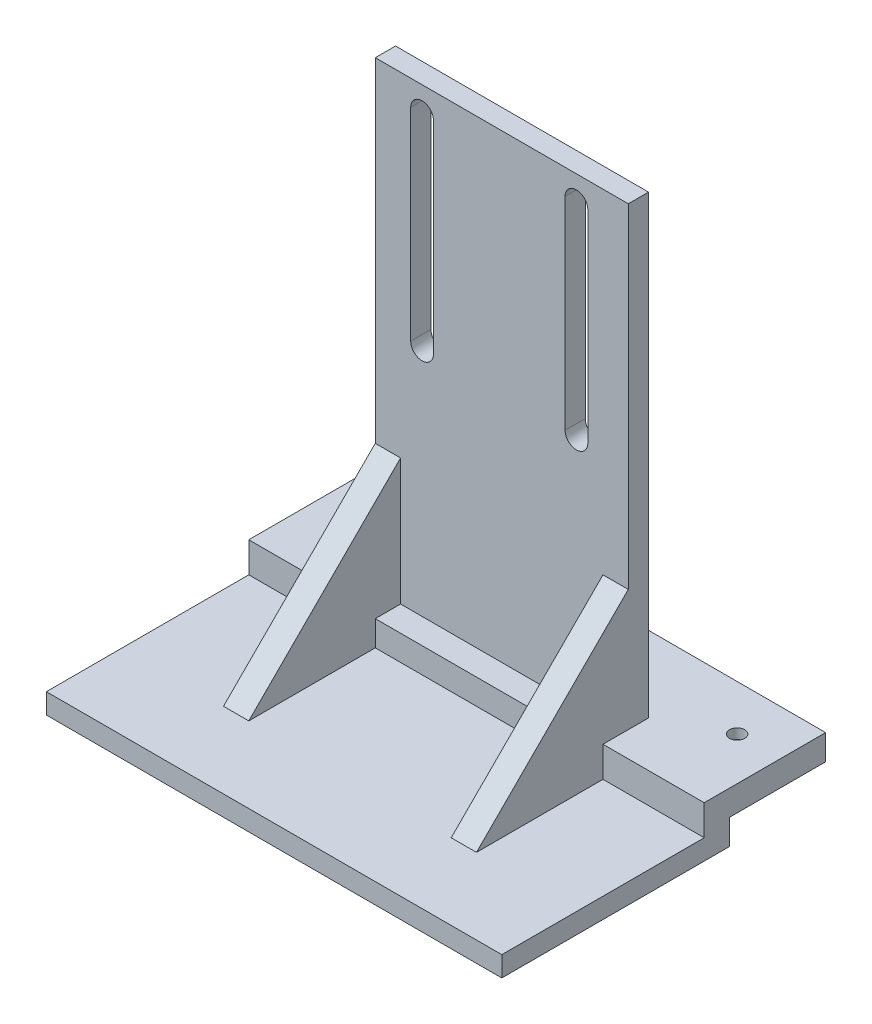
ISO-10303-21;
HEADER;
FILE_DESCRIPTION(('STEP AP214'),'2;1');
FILE_NAME('part.step','',(''),(''),'','','');
FILE_SCHEMA(('AUTOMOTIVE_DESIGN { 1 0 10303 214 1 1 1 1 }'));
ENDSEC;
DATA;
#1=APPLICATION_CONTEXT('core data for automotive mechanical design processes');
#2=APPLICATION_PROTOCOL_DEFINITION('international standard','automotive_design',2000,#1);
#3=PRODUCT_CONTEXT('',#1,'mechanical');
#4=PRODUCT('Part','Part','',(#3));
#5=PRODUCT_RELATED_PRODUCT_CATEGORY('part','',(#4));
#6=PRODUCT_DEFINITION_FORMATION('','',#4);
#7=PRODUCT_DEFINITION_CONTEXT('part definition',#1,'design');
#8=PRODUCT_DEFINITION('design','',#6,#7);
#9=PRODUCT_DEFINITION_SHAPE('','',#8);
#10=(LENGTH_UNIT() NAMED_UNIT(*) SI_UNIT(.MILLI.,.METRE.));
#11=(NAMED_UNIT(*) PLANE_ANGLE_UNIT() SI_UNIT($,.RADIAN.));
#12=(NAMED_UNIT(*) SI_UNIT($,.STERADIAN.) SOLID_ANGLE_UNIT());
#13=UNCERTAINTY_MEASURE_WITH_UNIT(LENGTH_MEASURE(1.E-05),#10,'distance_accuracy_value','');
#14=(GEOMETRIC_REPRESENTATION_CONTEXT(3) GLOBAL_UNCERTAINTY_ASSIGNED_CONTEXT((#13)) GLOBAL_UNIT_ASSIGNED_CONTEXT((#10,
#11,#12)) REPRESENTATION_CONTEXT('',''));
#15=CARTESIAN_POINT('',(0.,0.,0.));
#16=DIRECTION('',(0.,0.,1.));
#17=DIRECTION('',(1.,0.,0.));
#18=AXIS2_PLACEMENT_3D('',#15,#16,#17);
#19=CARTESIAN_POINT('',(-40.8939600904813,-66.0737955049441,-6.));
#20=DIRECTION('',(0.,1.,0.));
#21=DIRECTION('',(-1.,0.,0.));
#22=AXIS2_PLACEMENT_3D('',#19,#20,#21);
#23=CYLINDRICAL_SURFACE('',#22,1.5);
#24=CARTESIAN_POINT('',(-40.8939600904813,-56.0727955049441,-6.));
#25=DIRECTION('',(0.,1.,0.));
#26=DIRECTION('',(-1.,0.,0.));
#27=AXIS2_PLACEMENT_3D('',#24,#25,#26);
#28=CIRCLE('',#27,1.5);
#29=CARTESIAN_POINT('',(-42.3939600904813,-56.0727955049441,-6.));
#30=VERTEX_POINT('',#29);
#31=EDGE_CURVE('E264',#30,#30,#28,.T.);
#32=ORIENTED_EDGE('',*,*,#31,.T.);
#33=EDGE_LOOP('',(#32));
#34=FACE_BOUND('',#33,.T.);
#35=CARTESIAN_POINT('',(-40.8939600904813,-58.0727955049441,-6.));
#36=DIRECTION('',(0.,-1.,0.));
#37=DIRECTION('',(0.,0.,-1.));
#38=AXIS2_PLACEMENT_3D('',#35,#36,#37);
#39=CIRCLE('',#38,1.5);
#40=CARTESIAN_POINT('',(-40.8939600904813,-58.0727955049441,-7.5));
#41=VERTEX_POINT('',#40);
#42=EDGE_CURVE('E43',#41,#41,#39,.F.);
#43=ORIENTED_EDGE('',*,*,#42,.F.);
#44=EDGE_LOOP('',(#43));
#45=FACE_BOUND('',#44,.T.);
#46=ADVANCED_FACE('F39',(#34,#45),#23,.F.);
#47=CARTESIAN_POINT('',(32.1060399095187,-66.0737955049441,-6.));
#48=DIRECTION('',(0.,1.,0.));
#49=DIRECTION('',(-1.,0.,0.));
#50=AXIS2_PLACEMENT_3D('',#47,#48,#49);
#51=CYLINDRICAL_SURFACE('',#50,1.5);
#52=CARTESIAN_POINT('',(32.1060399095187,-56.0727955049441,-6.));
#53=DIRECTION('',(0.,1.,0.));
#54=DIRECTION('',(-1.,0.,0.));
#55=AXIS2_PLACEMENT_3D('',#52,#53,#54);
#56=CIRCLE('',#55,1.5);
#57=CARTESIAN_POINT('',(30.6060399095187,-56.0727955049441,-6.));
#58=VERTEX_POINT('',#57);
#59=EDGE_CURVE('E288',#58,#58,#56,.T.);
#60=ORIENTED_EDGE('',*,*,#59,.T.);
#61=EDGE_LOOP('',(#60));
#62=FACE_BOUND('',#61,.T.);
#63=CARTESIAN_POINT('',(32.1060399095187,-58.0727955049441,-6.));
#64=DIRECTION('',(0.,-1.,0.));
#65=DIRECTION('',(0.,0.,-1.));
#66=AXIS2_PLACEMENT_3D('',#63,#64,#65);
#67=CIRCLE('',#66,1.5);
#68=CARTESIAN_POINT('',(32.1060399095187,-58.0727955049441,-7.5));
#69=VERTEX_POINT('',#68);
#70=EDGE_CURVE('E532',#69,#69,#67,.F.);
#71=ORIENTED_EDGE('',*,*,#70,.F.);
#72=EDGE_LOOP('',(#71));
#73=FACE_BOUND('',#72,.T.);
#74=ADVANCED_FACE('F621',(#62,#73),#51,.F.);
#75=CARTESIAN_POINT('',(-29.3939600904813,33.9272044950559,4.));
#76=DIRECTION('',(1.,0.,0.));
#77=DIRECTION('',(0.,1.,0.));
#78=AXIS2_PLACEMENT_3D('',#75,#76,#77);
#79=PLANE('',#78);
#80=DIRECTION('',(0.,0.,-1.));
#81=VECTOR('',#80,1.);
#82=CARTESIAN_POINT('',(-29.3939600904812,-56.0727955049441,-15.));
#83=LINE('',#82,#81);
#84=CARTESIAN_POINT('',(-29.3939600904812,-56.0727955049441,9.));
#85=VERTEX_POINT('',#84);
#86=CARTESIAN_POINT('',(-29.3939600904812,-56.0727955049441,0.));
#87=VERTEX_POINT('',#86);
#88=EDGE_CURVE('E57',#85,#87,#83,.T.);
#89=ORIENTED_EDGE('',*,*,#88,.F.);
#90=DIRECTION('',(0.,1.,0.));
#91=VECTOR('',#90,1.);
#92=CARTESIAN_POINT('',(-29.3939600904812,-56.0727955049441,9.));
#93=LINE('',#92,#91);
#94=CARTESIAN_POINT('',(-29.3939600904812,-62.0727955049441,9.));
#95=VERTEX_POINT('',#94);
#96=EDGE_CURVE('E261',#95,#85,#93,.T.);
#97=ORIENTED_EDGE('',*,*,#96,.F.);
#98=DIRECTION('',(0.,0.,-1.));
#99=VECTOR('',#98,1.);
#100=CARTESIAN_POINT('',(-29.3939600904812,-62.0727955049441,9.));
#101=LINE('',#100,#99);
#102=CARTESIAN_POINT('',(-29.3939600904812,-62.0727955049441,34.));
#103=VERTEX_POINT('',#102);
#104=EDGE_CURVE('E11',#103,#95,#101,.T.);
#105=ORIENTED_EDGE('',*,*,#104,.F.);
#106=DIRECTION('',(0.,0.707106781186548,-0.707106781186547));
#107=VECTOR('',#106,1.);
#108=CARTESIAN_POINT('',(-29.3939600904812,-32.0727955049441,4.));
#109=LINE('',#108,#107);
#110=CARTESIAN_POINT('',(-29.3939600904812,-32.0727955049441,4.));
#111=VERTEX_POINT('',#110);
#112=EDGE_CURVE('E364',#103,#111,#109,.T.);
#113=ORIENTED_EDGE('',*,*,#112,.T.);
#114=DIRECTION('',(0.,-1.,0.));
#115=VECTOR('',#114,1.);
#116=CARTESIAN_POINT('',(-29.3939600904813,33.9272044950559,4.));
#117=LINE('',#116,#115);
#118=CARTESIAN_POINT('',(-29.3939600904813,33.9272044950559,4.));
#119=VERTEX_POINT('',#118);
#120=EDGE_CURVE('E504',#119,#111,#117,.T.);
#121=ORIENTED_EDGE('',*,*,#120,.F.);
#122=DIRECTION('',(0.,0.,-1.));
#123=VECTOR('',#122,1.);
#124=CARTESIAN_POINT('',(-29.3939600904813,33.9272044950559,4.));
#125=LINE('',#124,#123);
#126=CARTESIAN_POINT('',(-29.3939600904813,33.9272044950559,0.));
#127=VERTEX_POINT('',#126);
#128=EDGE_CURVE('E515',#119,#127,#125,.T.);
#129=ORIENTED_EDGE('',*,*,#128,.T.);
#130=DIRECTION('',(0.,-1.,0.));
#131=VECTOR('',#130,1.);
#132=CARTESIAN_POINT('',(-29.3939600904813,33.9272044950559,0.));
#133=LINE('',#132,#131);
#134=EDGE_CURVE('E501',#127,#87,#133,.T.);
#135=ORIENTED_EDGE('',*,*,#134,.T.);
#136=EDGE_LOOP('',(#89,#97,#105,#113,#121,#129,#135));
#137=FACE_BOUND('',#136,.T.);
#138=ADVANCED_FACE('F41',(#137),#79,.F.);
#139=CARTESIAN_POINT('',(20.6060399095187,33.9272044950559,4.));
#140=DIRECTION('',(-1.,0.,0.));
#141=DIRECTION('',(0.,-1.,0.));
#142=AXIS2_PLACEMENT_3D('',#139,#140,#141);
#143=PLANE('',#142);
#144=DIRECTION('',(0.,0.,1.));
#145=VECTOR('',#144,1.);
#146=CARTESIAN_POINT('',(20.6060399095188,-62.0727955049441,9.));
#147=LINE('',#146,#145);
#148=CARTESIAN_POINT('',(20.6060399095188,-62.0727955049441,9.));
#149=VERTEX_POINT('',#148);
#150=CARTESIAN_POINT('',(20.6060399095188,-62.0727955049441,34.));
#151=VERTEX_POINT('',#150);
#152=EDGE_CURVE('E65',#149,#151,#147,.T.);
#153=ORIENTED_EDGE('',*,*,#152,.F.);
#154=DIRECTION('',(0.,-1.,0.));
#155=VECTOR('',#154,1.);
#156=CARTESIAN_POINT('',(20.6060399095188,-56.0727955049441,9.));
#157=LINE('',#156,#155);
#158=CARTESIAN_POINT('',(20.6060399095188,-56.0727955049441,9.));
#159=VERTEX_POINT('',#158);
#160=EDGE_CURVE('E298',#159,#149,#157,.T.);
#161=ORIENTED_EDGE('',*,*,#160,.F.);
#162=DIRECTION('',(0.,0.,1.));
#163=VECTOR('',#162,1.);
#164=CARTESIAN_POINT('',(20.6060399095188,-56.0727955049441,0.));
#165=LINE('',#164,#163);
#166=CARTESIAN_POINT('',(20.6060399095188,-56.0727955049441,0.));
#167=VERTEX_POINT('',#166);
#168=EDGE_CURVE('E49',#167,#159,#165,.T.);
#169=ORIENTED_EDGE('',*,*,#168,.F.);
#170=DIRECTION('',(0.,1.,0.));
#171=VECTOR('',#170,1.);
#172=CARTESIAN_POINT('',(20.6060399095187,33.9272044950559,0.));
#173=LINE('',#172,#171);
#174=CARTESIAN_POINT('',(20.6060399095187,33.9272044950559,0.));
#175=VERTEX_POINT('',#174);
#176=EDGE_CURVE('E518',#167,#175,#173,.T.);
#177=ORIENTED_EDGE('',*,*,#176,.T.);
#178=DIRECTION('',(0.,0.,-1.));
#179=VECTOR('',#178,1.);
#180=CARTESIAN_POINT('',(20.6060399095187,33.9272044950559,4.));
#181=LINE('',#180,#179);
#182=CARTESIAN_POINT('',(20.6060399095187,33.9272044950559,4.));
#183=VERTEX_POINT('',#182);
#184=EDGE_CURVE('E526',#183,#175,#181,.T.);
#185=ORIENTED_EDGE('',*,*,#184,.F.);
#186=DIRECTION('',(0.,1.,0.));
#187=VECTOR('',#186,1.);
#188=CARTESIAN_POINT('',(20.6060399095187,33.9272044950559,4.));
#189=LINE('',#188,#187);
#190=CARTESIAN_POINT('',(20.6060399095188,-32.0727955049441,4.));
#191=VERTEX_POINT('',#190);
#192=EDGE_CURVE('E508',#191,#183,#189,.T.);
#193=ORIENTED_EDGE('',*,*,#192,.F.);
#194=DIRECTION('',(0.,-0.707106781186548,0.707106781186547));
#195=VECTOR('',#194,1.);
#196=CARTESIAN_POINT('',(20.6060399095188,-32.0727955049441,4.));
#197=LINE('',#196,#195);
#198=EDGE_CURVE('E339',#191,#151,#197,.T.);
#199=ORIENTED_EDGE('',*,*,#198,.T.);
#200=EDGE_LOOP('',(#153,#161,#169,#177,#185,#193,#199));
#201=FACE_BOUND('',#200,.T.);
#202=ADVANCED_FACE('F586',(#201),#143,.F.);
#203=CARTESIAN_POINT('',(0.,0.,9.));
#204=DIRECTION('',(0.,0.,-1.));
#205=DIRECTION('',(-1.,0.,0.));
#206=AXIS2_PLACEMENT_3D('',#203,#204,#205);
#207=PLANE('',#206);
#208=DIRECTION('',(-1.,0.,0.));
#209=VECTOR('',#208,1.);
#210=CARTESIAN_POINT('',(-29.3939600904812,-62.0727955049441,9.));
#211=LINE('',#210,#209);
#212=CARTESIAN_POINT('',(15.6060399095188,-62.0727955049441,9.));
#213=VERTEX_POINT('',#212);
#214=CARTESIAN_POINT('',(-24.3939600904812,-62.0727955049441,9.));
#215=VERTEX_POINT('',#214);
#216=EDGE_CURVE('E484',#213,#215,#211,.T.);
#217=ORIENTED_EDGE('',*,*,#216,.F.);
#218=DIRECTION('',(0.,1.,0.));
#219=VECTOR('',#218,1.);
#220=CARTESIAN_POINT('',(15.6060399095187,0.,9.));
#221=LINE('',#220,#219);
#222=CARTESIAN_POINT('',(15.6060399095188,-57.0727955049441,9.));
#223=VERTEX_POINT('',#222);
#224=EDGE_CURVE('E361',#213,#223,#221,.T.);
#225=ORIENTED_EDGE('',*,*,#224,.T.);
#226=DIRECTION('',(-1.,0.,0.));
#227=VECTOR('',#226,1.);
#228=CARTESIAN_POINT('',(-29.3939600904812,-57.0727955049441,9.));
#229=LINE('',#228,#227);
#230=CARTESIAN_POINT('',(-24.3939600904812,-57.0727955049441,9.));
#231=VERTEX_POINT('',#230);
#232=EDGE_CURVE('E498',#223,#231,#229,.T.);
#233=ORIENTED_EDGE('',*,*,#232,.T.);
#234=DIRECTION('',(0.,1.,0.));
#235=VECTOR('',#234,1.);
#236=CARTESIAN_POINT('',(-24.3939600904812,0.,9.));
#237=LINE('',#236,#235);
#238=EDGE_CURVE('E387',#215,#231,#237,.T.);
#239=ORIENTED_EDGE('',*,*,#238,.F.);
#240=EDGE_LOOP('',(#217,#225,#233,#239));
#241=FACE_BOUND('',#240,.T.);
#242=ADVANCED_FACE('F925',(#241),#207,.F.);
#243=CARTESIAN_POINT('',(-29.3939600904812,-57.0727955049441,9.));
#244=DIRECTION('',(0.,-1.,0.));
#245=DIRECTION('',(0.,0.,-1.));
#246=AXIS2_PLACEMENT_3D('',#243,#244,#245);
#247=PLANE('',#246);
#248=ORIENTED_EDGE('',*,*,#232,.F.);
#249=DIRECTION('',(0.,0.,-1.));
#250=VECTOR('',#249,1.);
#251=CARTESIAN_POINT('',(15.6060399095188,-57.0727955049441,9.));
#252=LINE('',#251,#250);
#253=CARTESIAN_POINT('',(15.6060399095188,-57.0727955049441,4.));
#254=VERTEX_POINT('',#253);
#255=EDGE_CURVE('E356',#223,#254,#252,.T.);
#256=ORIENTED_EDGE('',*,*,#255,.T.);
#257=DIRECTION('',(-1.,0.,0.));
#258=VECTOR('',#257,1.);
#259=CARTESIAN_POINT('',(-29.3939600904812,-57.0727955049441,4.));
#260=LINE('',#259,#258);
#261=CARTESIAN_POINT('',(-24.3939600904812,-57.0727955049441,4.));
#262=VERTEX_POINT('',#261);
#263=EDGE_CURVE('E495',#254,#262,#260,.T.);
#264=ORIENTED_EDGE('',*,*,#263,.T.);
#265=DIRECTION('',(0.,0.,-1.));
#266=VECTOR('',#265,1.);
#267=CARTESIAN_POINT('',(-24.3939600904812,-57.0727955049441,9.));
#268=LINE('',#267,#266);
#269=EDGE_CURVE('E380',#231,#262,#268,.T.);
#270=ORIENTED_EDGE('',*,*,#269,.F.);
#271=EDGE_LOOP('',(#248,#256,#264,#270));
#272=FACE_BOUND('',#271,.T.);
#273=ADVANCED_FACE('F897',(#272),#247,.F.);
#274=CARTESIAN_POINT('',(0.,0.,0.));
#275=DIRECTION('',(0.,0.,1.));
#276=DIRECTION('',(1.,0.,0.));
#277=AXIS2_PLACEMENT_3D('',#274,#275,#276);
#278=PLANE('',#277);
#279=DIRECTION('',(0.,-1.,0.));
#280=VECTOR('',#279,1.);
#281=CARTESIAN_POINT('',(-17.8939600904813,28.9272044950559,0.));
#282=LINE('',#281,#280);
#283=CARTESIAN_POINT('',(-17.8939600904813,28.9272044950559,0.));
#284=VERTEX_POINT('',#283);
#285=CARTESIAN_POINT('',(-17.8939600904812,-11.0727955049441,0.));
#286=VERTEX_POINT('',#285);
#287=EDGE_CURVE('E395',#284,#286,#282,.T.);
#288=ORIENTED_EDGE('',*,*,#287,.F.);
#289=CARTESIAN_POINT('',(-20.1439600904813,28.9272044950559,0.));
#290=DIRECTION('',(0.,0.,1.));
#291=DIRECTION('',(1.,0.,0.));
#292=AXIS2_PLACEMENT_3D('',#289,#290,#291);
#293=CIRCLE('',#292,2.25);
#294=CARTESIAN_POINT('',(-22.3939600904813,28.9272044950559,0.));
#295=VERTEX_POINT('',#294);
#296=EDGE_CURVE('E400',#295,#284,#293,.F.);
#297=ORIENTED_EDGE('',*,*,#296,.F.);
#298=DIRECTION('',(0.,1.,0.));
#299=VECTOR('',#298,1.);
#300=CARTESIAN_POINT('',(-22.3939600904813,28.9272044950559,0.));
#301=LINE('',#300,#299);
#302=CARTESIAN_POINT('',(-22.3939600904813,-11.0727955049441,0.));
#303=VERTEX_POINT('',#302);
#304=EDGE_CURVE('E423',#303,#295,#301,.T.);
#305=ORIENTED_EDGE('',*,*,#304,.F.);
#306=CARTESIAN_POINT('',(-20.1439600904813,-11.0727955049441,0.));
#307=DIRECTION('',(0.,0.,1.));
#308=DIRECTION('',(1.,0.,0.));
#309=AXIS2_PLACEMENT_3D('',#306,#307,#308);
#310=CIRCLE('',#309,2.25000000000001);
#311=EDGE_CURVE('E392',#286,#303,#310,.F.);
#312=ORIENTED_EDGE('',*,*,#311,.F.);
#313=EDGE_LOOP('',(#288,#297,#305,#312));
#314=FACE_BOUND('',#313,.T.);
#315=DIRECTION('',(0.,-1.,0.));
#316=VECTOR('',#315,1.);
#317=CARTESIAN_POINT('',(12.6060399095187,28.9272044950559,0.));
#318=LINE('',#317,#316);
#319=CARTESIAN_POINT('',(12.6060399095187,28.9272044950559,0.));
#320=VERTEX_POINT('',#319);
#321=CARTESIAN_POINT('',(12.6060399095188,-11.0727955049441,0.));
#322=VERTEX_POINT('',#321);
#323=EDGE_CURVE('E439',#320,#322,#318,.T.);
#324=ORIENTED_EDGE('',*,*,#323,.F.);
#325=CARTESIAN_POINT('',(10.3560399095187,28.9272044950559,0.));
#326=DIRECTION('',(0.,0.,1.));
#327=DIRECTION('',(1.,0.,0.));
#328=AXIS2_PLACEMENT_3D('',#325,#326,#327);
#329=CIRCLE('',#328,2.25);
#330=CARTESIAN_POINT('',(8.10603990951874,28.9272044950559,0.));
#331=VERTEX_POINT('',#330);
#332=EDGE_CURVE('E443',#331,#320,#329,.F.);
#333=ORIENTED_EDGE('',*,*,#332,.F.);
#334=DIRECTION('',(0.,1.,0.));
#335=VECTOR('',#334,1.);
#336=CARTESIAN_POINT('',(8.10603990951874,28.9272044950559,0.));
#337=LINE('',#336,#335);
#338=CARTESIAN_POINT('',(8.10603990951874,-11.0727955049441,0.));
#339=VERTEX_POINT('',#338);
#340=EDGE_CURVE('E396',#339,#331,#337,.T.);
#341=ORIENTED_EDGE('',*,*,#340,.F.);
#342=CARTESIAN_POINT('',(10.3560399095187,-11.0727955049441,0.));
#343=DIRECTION('',(0.,0.,1.));
#344=DIRECTION('',(1.,0.,0.));
#345=AXIS2_PLACEMENT_3D('',#342,#343,#344);
#346=CIRCLE('',#345,2.25000000000001);
#347=EDGE_CURVE('E391',#322,#339,#346,.F.);
#348=ORIENTED_EDGE('',*,*,#347,.F.);
#349=EDGE_LOOP('',(#324,#333,#341,#348));
#350=FACE_BOUND('',#349,.T.);
#351=DIRECTION('',(1.,0.,0.));
#352=VECTOR('',#351,1.);
#353=CARTESIAN_POINT('',(20.6060399095188,-56.0727955049441,0.));
#354=LINE('',#353,#352);
#355=EDGE_CURVE('E436',#87,#167,#354,.T.);
#356=ORIENTED_EDGE('',*,*,#355,.F.);
#357=ORIENTED_EDGE('',*,*,#134,.F.);
#358=DIRECTION('',(-1.,0.,0.));
#359=VECTOR('',#358,1.);
#360=CARTESIAN_POINT('',(-29.3939600904813,33.9272044950559,0.));
#361=LINE('',#360,#359);
#362=EDGE_CURVE('E509',#175,#127,#361,.T.);
#363=ORIENTED_EDGE('',*,*,#362,.F.);
#364=ORIENTED_EDGE('',*,*,#176,.F.);
#365=EDGE_LOOP('',(#356,#357,#363,#364));
#366=FACE_BOUND('',#365,.T.);
#367=ADVANCED_FACE('F577',(#314,#350,#366),#278,.F.);
#368=CARTESIAN_POINT('',(-29.3939600904812,-61.0727955049441,4.));
#369=DIRECTION('',(0.,1.,0.));
#370=DIRECTION('',(0.,0.,1.));
#371=AXIS2_PLACEMENT_3D('',#368,#369,#370);
#372=PLANE('',#371);
#373=CARTESIAN_POINT('',(32.1060399095187,-61.0727955049441,-6.));
#374=DIRECTION('',(0.,-1.,0.));
#375=DIRECTION('',(0.,0.,-1.));
#376=AXIS2_PLACEMENT_3D('',#373,#374,#375);
#377=CIRCLE('',#376,2.);
#378=CARTESIAN_POINT('',(32.1060399095187,-61.0727955049441,-8.));
#379=VERTEX_POINT('',#378);
#380=EDGE_CURVE('E542',#379,#379,#377,.T.);
#381=ORIENTED_EDGE('',*,*,#380,.F.);
#382=EDGE_LOOP('',(#381));
#383=FACE_BOUND('',#382,.T.);
#384=CARTESIAN_POINT('',(-40.8939600904813,-61.0727955049441,-6.));
#385=DIRECTION('',(0.,-1.,0.));
#386=DIRECTION('',(0.,0.,-1.));
#387=AXIS2_PLACEMENT_3D('',#384,#385,#386);
#388=CIRCLE('',#387,2.);
#389=CARTESIAN_POINT('',(-40.8939600904813,-61.0727955049441,-8.));
#390=VERTEX_POINT('',#389);
#391=EDGE_CURVE('E554',#390,#390,#388,.T.);
#392=ORIENTED_EDGE('',*,*,#391,.F.);
#393=EDGE_LOOP('',(#392));
#394=FACE_BOUND('',#393,.T.);
#395=DIRECTION('',(1.,0.,0.));
#396=VECTOR('',#395,1.);
#397=CARTESIAN_POINT('',(20.6060399095188,-61.0727955049441,4.));
#398=LINE('',#397,#396);
#399=CARTESIAN_POINT('',(-49.3939600904813,-61.0727955049441,4.));
#400=VERTEX_POINT('',#399);
#401=CARTESIAN_POINT('',(40.6060399095188,-61.0727955049441,4.));
#402=VERTEX_POINT('',#401);
#403=EDGE_CURVE('E240',#400,#402,#398,.T.);
#404=ORIENTED_EDGE('',*,*,#403,.F.);
#405=DIRECTION('',(0.,0.,1.));
#406=VECTOR('',#405,1.);
#407=CARTESIAN_POINT('',(-49.3939600904813,-61.0727955049441,4.));
#408=LINE('',#407,#406);
#409=CARTESIAN_POINT('',(-49.3939600904813,-61.0727955049441,-15.));
#410=VERTEX_POINT('',#409);
#411=EDGE_CURVE('E277',#410,#400,#408,.T.);
#412=ORIENTED_EDGE('',*,*,#411,.F.);
#413=DIRECTION('',(-1.,0.,0.));
#414=VECTOR('',#413,1.);
#415=CARTESIAN_POINT('',(20.6060399095188,-61.0727955049441,-15.));
#416=LINE('',#415,#414);
#417=CARTESIAN_POINT('',(40.6060399095188,-61.0727955049441,-15.));
#418=VERTEX_POINT('',#417);
#419=EDGE_CURVE('E478',#418,#410,#416,.T.);
#420=ORIENTED_EDGE('',*,*,#419,.F.);
#421=DIRECTION('',(0.,0.,-1.));
#422=VECTOR('',#421,1.);
#423=CARTESIAN_POINT('',(40.6060399095188,-61.0727955049441,4.));
#424=LINE('',#423,#422);
#425=EDGE_CURVE('E309',#402,#418,#424,.T.);
#426=ORIENTED_EDGE('',*,*,#425,.F.);
#427=EDGE_LOOP('',(#404,#412,#420,#426));
#428=FACE_BOUND('',#427,.T.);
#429=ADVANCED_FACE('F604',(#383,#394,#428),#372,.F.);
#430=CARTESIAN_POINT('',(-29.3939600904813,33.9272044950559,4.));
#431=DIRECTION('',(0.,-1.,0.));
#432=DIRECTION('',(0.,0.,-1.));
#433=AXIS2_PLACEMENT_3D('',#430,#431,#432);
#434=PLANE('',#433);
#435=ORIENTED_EDGE('',*,*,#362,.T.);
#436=ORIENTED_EDGE('',*,*,#128,.F.);
#437=DIRECTION('',(-1.,0.,0.));
#438=VECTOR('',#437,1.);
#439=CARTESIAN_POINT('',(-29.3939600904813,33.9272044950559,4.));
#440=LINE('',#439,#438);
#441=EDGE_CURVE('E512',#183,#119,#440,.T.);
#442=ORIENTED_EDGE('',*,*,#441,.F.);
#443=ORIENTED_EDGE('',*,*,#184,.T.);
#444=EDGE_LOOP('',(#435,#436,#442,#443));
#445=FACE_BOUND('',#444,.T.);
#446=ADVANCED_FACE('F583',(#445),#434,.F.);
#447=CARTESIAN_POINT('',(0.,0.,4.));
#448=DIRECTION('',(0.,0.,1.));
#449=DIRECTION('',(1.,0.,0.));
#450=AXIS2_PLACEMENT_3D('',#447,#448,#449);
#451=PLANE('',#450);
#452=DIRECTION('',(1.,0.,0.));
#453=VECTOR('',#452,1.);
#454=CARTESIAN_POINT('',(15.6060399095188,-32.0727955049441,4.));
#455=LINE('',#454,#453);
#456=CARTESIAN_POINT('',(15.6060399095188,-32.0727955049441,4.));
#457=VERTEX_POINT('',#456);
#458=EDGE_CURVE('E350',#457,#191,#455,.T.);
#459=ORIENTED_EDGE('',*,*,#458,.T.);
#460=ORIENTED_EDGE('',*,*,#192,.T.);
#461=ORIENTED_EDGE('',*,*,#441,.T.);
#462=ORIENTED_EDGE('',*,*,#120,.T.);
#463=DIRECTION('',(-1.,0.,0.));
#464=VECTOR('',#463,1.);
#465=CARTESIAN_POINT('',(-24.3939600904812,-32.0727955049441,4.));
#466=LINE('',#465,#464);
#467=CARTESIAN_POINT('',(-24.3939600904812,-32.0727955049441,4.));
#468=VERTEX_POINT('',#467);
#469=EDGE_CURVE('E377',#468,#111,#466,.T.);
#470=ORIENTED_EDGE('',*,*,#469,.F.);
#471=DIRECTION('',(0.,-1.,0.));
#472=VECTOR('',#471,1.);
#473=CARTESIAN_POINT('',(-24.3939600904812,-62.0727955049441,4.));
#474=LINE('',#473,#472);
#475=EDGE_CURVE('E365',#468,#262,#474,.T.);
#476=ORIENTED_EDGE('',*,*,#475,.T.);
#477=ORIENTED_EDGE('',*,*,#263,.F.);
#478=DIRECTION('',(0.,1.,0.));
#479=VECTOR('',#478,1.);
#480=CARTESIAN_POINT('',(15.6060399095188,-62.0727955049441,4.));
#481=LINE('',#480,#479);
#482=EDGE_CURVE('E340',#254,#457,#481,.T.);
#483=ORIENTED_EDGE('',*,*,#482,.T.);
#484=EDGE_LOOP('',(#459,#460,#461,#462,#470,#476,#477,#483));
#485=FACE_BOUND('',#484,.T.);
#486=CARTESIAN_POINT('',(-20.1439600904813,28.9272044950559,4.));
#487=DIRECTION('',(0.,0.,1.));
#488=DIRECTION('',(1.,0.,0.));
#489=AXIS2_PLACEMENT_3D('',#486,#487,#488);
#490=CIRCLE('',#489,2.25);
#491=CARTESIAN_POINT('',(-17.8939600904813,28.9272044950559,4.));
#492=VERTEX_POINT('',#491);
#493=CARTESIAN_POINT('',(-22.3939600904813,28.9272044950559,4.));
#494=VERTEX_POINT('',#493);
#495=EDGE_CURVE('E404',#492,#494,#490,.T.);
#496=ORIENTED_EDGE('',*,*,#495,.F.);
#497=DIRECTION('',(0.,1.,0.));
#498=VECTOR('',#497,1.);
#499=CARTESIAN_POINT('',(-17.8939600904813,28.9272044950559,4.));
#500=LINE('',#499,#498);
#501=CARTESIAN_POINT('',(-17.8939600904812,-11.0727955049441,4.));
#502=VERTEX_POINT('',#501);
#503=EDGE_CURVE('E415',#502,#492,#500,.T.);
#504=ORIENTED_EDGE('',*,*,#503,.F.);
#505=CARTESIAN_POINT('',(-20.1439600904813,-11.0727955049441,4.));
#506=DIRECTION('',(0.,0.,1.));
#507=DIRECTION('',(1.,0.,0.));
#508=AXIS2_PLACEMENT_3D('',#505,#506,#507);
#509=CIRCLE('',#508,2.25000000000001);
#510=CARTESIAN_POINT('',(-22.3939600904813,-11.0727955049441,4.));
#511=VERTEX_POINT('',#510);
#512=EDGE_CURVE('E411',#511,#502,#509,.T.);
#513=ORIENTED_EDGE('',*,*,#512,.F.);
#514=DIRECTION('',(0.,-1.,0.));
#515=VECTOR('',#514,1.);
#516=CARTESIAN_POINT('',(-22.3939600904813,28.9272044950559,4.));
#517=LINE('',#516,#515);
#518=EDGE_CURVE('E407',#494,#511,#517,.T.);
#519=ORIENTED_EDGE('',*,*,#518,.F.);
#520=EDGE_LOOP('',(#496,#504,#513,#519));
#521=FACE_BOUND('',#520,.T.);
#522=CARTESIAN_POINT('',(10.3560399095187,28.9272044950559,4.));
#523=DIRECTION('',(0.,0.,1.));
#524=DIRECTION('',(1.,0.,0.));
#525=AXIS2_PLACEMENT_3D('',#522,#523,#524);
#526=CIRCLE('',#525,2.25);
#527=CARTESIAN_POINT('',(12.6060399095187,28.9272044950559,4.));
#528=VERTEX_POINT('',#527);
#529=CARTESIAN_POINT('',(8.10603990951874,28.9272044950559,4.));
#530=VERTEX_POINT('',#529);
#531=EDGE_CURVE('E447',#528,#530,#526,.T.);
#532=ORIENTED_EDGE('',*,*,#531,.F.);
#533=DIRECTION('',(0.,1.,0.));
#534=VECTOR('',#533,1.);
#535=CARTESIAN_POINT('',(12.6060399095187,28.9272044950559,4.));
#536=LINE('',#535,#534);
#537=CARTESIAN_POINT('',(12.6060399095188,-11.0727955049441,4.));
#538=VERTEX_POINT('',#537);
#539=EDGE_CURVE('E458',#538,#528,#536,.T.);
#540=ORIENTED_EDGE('',*,*,#539,.F.);
#541=CARTESIAN_POINT('',(10.3560399095187,-11.0727955049441,4.));
#542=DIRECTION('',(0.,0.,1.));
#543=DIRECTION('',(1.,0.,0.));
#544=AXIS2_PLACEMENT_3D('',#541,#542,#543);
#545=CIRCLE('',#544,2.25000000000001);
#546=CARTESIAN_POINT('',(8.10603990951874,-11.0727955049441,4.));
#547=VERTEX_POINT('',#546);
#548=EDGE_CURVE('E454',#547,#538,#545,.T.);
#549=ORIENTED_EDGE('',*,*,#548,.F.);
#550=DIRECTION('',(0.,-1.,0.));
#551=VECTOR('',#550,1.);
#552=CARTESIAN_POINT('',(8.10603990951874,28.9272044950559,4.));
#553=LINE('',#552,#551);
#554=EDGE_CURVE('E450',#530,#547,#553,.T.);
#555=ORIENTED_EDGE('',*,*,#554,.F.);
#556=EDGE_LOOP('',(#532,#540,#549,#555));
#557=FACE_BOUND('',#556,.T.);
#558=ADVANCED_FACE('F618',(#485,#521,#557),#451,.T.);
#559=CARTESIAN_POINT('',(20.6060399095188,-66.0727955049441,4.));
#560=DIRECTION('',(0.,0.,1.));
#561=DIRECTION('',(1.,0.,0.));
#562=AXIS2_PLACEMENT_3D('',#559,#560,#561);
#563=PLANE('',#562);
#564=ORIENTED_EDGE('',*,*,#403,.T.);
#565=DIRECTION('',(0.,1.,0.));
#566=VECTOR('',#565,1.);
#567=CARTESIAN_POINT('',(40.6060399095188,-66.0727955049441,4.));
#568=LINE('',#567,#566);
#569=CARTESIAN_POINT('',(40.6060399095188,-66.0727955049441,4.));
#570=VERTEX_POINT('',#569);
#571=EDGE_CURVE('E305',#570,#402,#568,.T.);
#572=ORIENTED_EDGE('',*,*,#571,.F.);
#573=DIRECTION('',(1.,0.,0.));
#574=VECTOR('',#573,1.);
#575=CARTESIAN_POINT('',(20.6060399095188,-66.0727955049441,4.));
#576=LINE('',#575,#574);
#577=CARTESIAN_POINT('',(-49.3939600904813,-66.0727955049441,3.99999999999999));
#578=VERTEX_POINT('',#577);
#579=EDGE_CURVE('E492',#578,#570,#576,.T.);
#580=ORIENTED_EDGE('',*,*,#579,.F.);
#581=DIRECTION('',(0.,-1.,0.));
#582=VECTOR('',#581,1.);
#583=CARTESIAN_POINT('',(-49.3939600904813,-66.0727955049441,3.99999999999999));
#584=LINE('',#583,#582);
#585=EDGE_CURVE('E281',#400,#578,#584,.T.);
#586=ORIENTED_EDGE('',*,*,#585,.F.);
#587=EDGE_LOOP('',(#564,#572,#580,#586));
#588=FACE_BOUND('',#587,.T.);
#589=ADVANCED_FACE('F607',(#588),#563,.F.);
#590=CARTESIAN_POINT('',(0.,-66.0727955049441,0.));
#591=DIRECTION('',(0.,1.,0.));
#592=DIRECTION('',(0.,0.,1.));
#593=AXIS2_PLACEMENT_3D('',#590,#591,#592);
#594=PLANE('',#593);
#595=ORIENTED_EDGE('',*,*,#579,.T.);
#596=DIRECTION('',(0.,0.,-1.));
#597=VECTOR('',#596,1.);
#598=CARTESIAN_POINT('',(40.6060399095188,-66.0727955049441,49.));
#599=LINE('',#598,#597);
#600=CARTESIAN_POINT('',(40.6060399095188,-66.0727955049441,49.));
#601=VERTEX_POINT('',#600);
#602=EDGE_CURVE('E301',#601,#570,#599,.T.);
#603=ORIENTED_EDGE('',*,*,#602,.F.);
#604=DIRECTION('',(1.,0.,0.));
#605=VECTOR('',#604,1.);
#606=CARTESIAN_POINT('',(-29.3939600904812,-66.0727955049441,49.));
#607=LINE('',#606,#605);
#608=CARTESIAN_POINT('',(-49.3939600904813,-66.0727955049441,49.));
#609=VERTEX_POINT('',#608);
#610=EDGE_CURVE('E241',#609,#601,#607,.T.);
#611=ORIENTED_EDGE('',*,*,#610,.F.);
#612=DIRECTION('',(0.,0.,1.));
#613=VECTOR('',#612,1.);
#614=CARTESIAN_POINT('',(-49.3939600904813,-66.0727955049441,49.));
#615=LINE('',#614,#613);
#616=EDGE_CURVE('E257',#578,#609,#615,.T.);
#617=ORIENTED_EDGE('',*,*,#616,.F.);
#618=EDGE_LOOP('',(#595,#603,#611,#617));
#619=FACE_BOUND('',#618,.T.);
#620=ADVANCED_FACE('F610',(#619),#594,.F.);
#621=CARTESIAN_POINT('',(-29.3939600904812,-62.0727955049441,49.));
#622=DIRECTION('',(0.,-1.,0.));
#623=DIRECTION('',(0.,0.,-1.));
#624=AXIS2_PLACEMENT_3D('',#621,#622,#623);
#625=PLANE('',#624);
#626=DIRECTION('',(-1.,0.,0.));
#627=VECTOR('',#626,1.);
#628=CARTESIAN_POINT('',(-29.3939600904812,-62.0727955049441,49.));
#629=LINE('',#628,#627);
#630=CARTESIAN_POINT('',(40.6060399095188,-62.0727955049441,49.));
#631=VERTEX_POINT('',#630);
#632=CARTESIAN_POINT('',(-49.3939600904813,-62.0727955049441,49.));
#633=VERTEX_POINT('',#632);
#634=EDGE_CURVE('E229',#631,#633,#629,.T.);
#635=ORIENTED_EDGE('',*,*,#634,.F.);
#636=DIRECTION('',(0.,0.,1.));
#637=VECTOR('',#636,1.);
#638=CARTESIAN_POINT('',(40.6060399095188,-62.0727955049441,9.));
#639=LINE('',#638,#637);
#640=CARTESIAN_POINT('',(40.6060399095188,-62.0727955049441,9.));
#641=VERTEX_POINT('',#640);
#642=EDGE_CURVE('E295',#641,#631,#639,.T.);
#643=ORIENTED_EDGE('',*,*,#642,.F.);
#644=DIRECTION('',(-1.,0.,0.));
#645=VECTOR('',#644,1.);
#646=CARTESIAN_POINT('',(40.6060399095188,-62.0727955049441,9.));
#647=LINE('',#646,#645);
#648=EDGE_CURVE('E323',#641,#149,#647,.T.);
#649=ORIENTED_EDGE('',*,*,#648,.T.);
#650=ORIENTED_EDGE('',*,*,#152,.T.);
#651=DIRECTION('',(1.,0.,0.));
#652=VECTOR('',#651,1.);
#653=CARTESIAN_POINT('',(15.6060399095188,-62.0727955049441,34.));
#654=LINE('',#653,#652);
#655=CARTESIAN_POINT('',(15.6060399095188,-62.0727955049441,34.));
#656=VERTEX_POINT('',#655);
#657=EDGE_CURVE('E353',#656,#151,#654,.T.);
#658=ORIENTED_EDGE('',*,*,#657,.F.);
#659=DIRECTION('',(0.,0.,-1.));
#660=VECTOR('',#659,1.);
#661=CARTESIAN_POINT('',(15.6060399095188,-62.0727955049441,34.));
#662=LINE('',#661,#660);
#663=EDGE_CURVE('E347',#656,#213,#662,.T.);
#664=ORIENTED_EDGE('',*,*,#663,.T.);
#665=ORIENTED_EDGE('',*,*,#216,.T.);
#666=DIRECTION('',(0.,0.,-1.));
#667=VECTOR('',#666,1.);
#668=CARTESIAN_POINT('',(-24.3939600904812,-62.0727955049441,49.));
#669=LINE('',#668,#667);
#670=CARTESIAN_POINT('',(-24.3939600904812,-62.0727955049441,34.));
#671=VERTEX_POINT('',#670);
#672=EDGE_CURVE('E329',#671,#215,#669,.T.);
#673=ORIENTED_EDGE('',*,*,#672,.F.);
#674=DIRECTION('',(-1.,0.,0.));
#675=VECTOR('',#674,1.);
#676=CARTESIAN_POINT('',(-24.3939600904812,-62.0727955049441,34.));
#677=LINE('',#676,#675);
#678=EDGE_CURVE('E373',#671,#103,#677,.T.);
#679=ORIENTED_EDGE('',*,*,#678,.T.);
#680=ORIENTED_EDGE('',*,*,#104,.T.);
#681=DIRECTION('',(1.,0.,0.));
#682=VECTOR('',#681,1.);
#683=CARTESIAN_POINT('',(-49.3939600904813,-62.0727955049441,9.));
#684=LINE('',#683,#682);
#685=CARTESIAN_POINT('',(-49.3939600904813,-62.0727955049441,9.));
#686=VERTEX_POINT('',#685);
#687=EDGE_CURVE('E247',#686,#95,#684,.T.);
#688=ORIENTED_EDGE('',*,*,#687,.F.);
#689=DIRECTION('',(0.,0.,-1.));
#690=VECTOR('',#689,1.);
#691=CARTESIAN_POINT('',(-49.3939600904813,-62.0727955049441,9.));
#692=LINE('',#691,#690);
#693=EDGE_CURVE('E244',#633,#686,#692,.T.);
#694=ORIENTED_EDGE('',*,*,#693,.F.);
#695=EDGE_LOOP('',(#635,#643,#649,#650,#658,#664,#665,#673,#679,#680,#688,#694));
#696=FACE_BOUND('',#695,.T.);
#697=ADVANCED_FACE('F245',(#696),#625,.F.);
#698=CARTESIAN_POINT('',(0.,0.,49.));
#699=DIRECTION('',(0.,0.,-1.));
#700=DIRECTION('',(-1.,0.,0.));
#701=AXIS2_PLACEMENT_3D('',#698,#699,#700);
#702=PLANE('',#701);
#703=ORIENTED_EDGE('',*,*,#634,.T.);
#704=DIRECTION('',(0.,1.,0.));
#705=VECTOR('',#704,1.);
#706=CARTESIAN_POINT('',(-49.3939600904813,-66.0727955049441,49.));
#707=LINE('',#706,#705);
#708=EDGE_CURVE('E233',#609,#633,#707,.T.);
#709=ORIENTED_EDGE('',*,*,#708,.F.);
#710=ORIENTED_EDGE('',*,*,#610,.T.);
#711=DIRECTION('',(0.,-1.,0.));
#712=VECTOR('',#711,1.);
#713=CARTESIAN_POINT('',(40.6060399095188,-62.0727955049441,49.));
#714=LINE('',#713,#712);
#715=EDGE_CURVE('E235',#631,#601,#714,.T.);
#716=ORIENTED_EDGE('',*,*,#715,.F.);
#717=EDGE_LOOP('',(#703,#709,#710,#716));
#718=FACE_BOUND('',#717,.T.);
#719=ADVANCED_FACE('F231',(#718),#702,.F.);
#720=CARTESIAN_POINT('',(20.6060399095188,-56.0727955049441,-15.));
#721=DIRECTION('',(0.,-1.,0.));
#722=DIRECTION('',(1.,0.,0.));
#723=AXIS2_PLACEMENT_3D('',#720,#721,#722);
#724=PLANE('',#723);
#725=ORIENTED_EDGE('',*,*,#59,.F.);
#726=EDGE_LOOP('',(#725));
#727=FACE_BOUND('',#726,.T.);
#728=ORIENTED_EDGE('',*,*,#31,.F.);
#729=EDGE_LOOP('',(#728));
#730=FACE_BOUND('',#729,.T.);
#731=ORIENTED_EDGE('',*,*,#355,.T.);
#732=ORIENTED_EDGE('',*,*,#168,.T.);
#733=DIRECTION('',(-1.,0.,0.));
#734=VECTOR('',#733,1.);
#735=CARTESIAN_POINT('',(40.6060399095188,-56.0727955049441,9.));
#736=LINE('',#735,#734);
#737=CARTESIAN_POINT('',(40.6060399095188,-56.0727955049441,9.));
#738=VERTEX_POINT('',#737);
#739=EDGE_CURVE('E335',#738,#159,#736,.T.);
#740=ORIENTED_EDGE('',*,*,#739,.F.);
#741=DIRECTION('',(0.,0.,1.));
#742=VECTOR('',#741,1.);
#743=CARTESIAN_POINT('',(40.6060399095188,-56.0727955049441,-15.));
#744=LINE('',#743,#742);
#745=CARTESIAN_POINT('',(40.6060399095188,-56.0727955049441,-15.));
#746=VERTEX_POINT('',#745);
#747=EDGE_CURVE('E317',#746,#738,#744,.T.);
#748=ORIENTED_EDGE('',*,*,#747,.F.);
#749=DIRECTION('',(1.,0.,0.));
#750=VECTOR('',#749,1.);
#751=CARTESIAN_POINT('',(20.6060399095188,-56.0727955049441,-15.));
#752=LINE('',#751,#750);
#753=CARTESIAN_POINT('',(-49.3939600904813,-56.0727955049441,-15.));
#754=VERTEX_POINT('',#753);
#755=EDGE_CURVE('E481',#754,#746,#752,.T.);
#756=ORIENTED_EDGE('',*,*,#755,.F.);
#757=DIRECTION('',(0.,0.,-1.));
#758=VECTOR('',#757,1.);
#759=CARTESIAN_POINT('',(-49.3939600904813,-56.0727955049441,0.));
#760=LINE('',#759,#758);
#761=CARTESIAN_POINT('',(-49.3939600904813,-56.0727955049441,9.));
#762=VERTEX_POINT('',#761);
#763=EDGE_CURVE('E269',#762,#754,#760,.T.);
#764=ORIENTED_EDGE('',*,*,#763,.F.);
#765=DIRECTION('',(1.,0.,0.));
#766=VECTOR('',#765,1.);
#767=CARTESIAN_POINT('',(-49.3939600904813,-56.0727955049441,9.));
#768=LINE('',#767,#766);
#769=EDGE_CURVE('E285',#762,#85,#768,.T.);
#770=ORIENTED_EDGE('',*,*,#769,.T.);
#771=ORIENTED_EDGE('',*,*,#88,.T.);
#772=EDGE_LOOP('',(#731,#732,#740,#748,#756,#764,#770,#771));
#773=FACE_BOUND('',#772,.T.);
#774=ADVANCED_FACE('F567',(#727,#730,#773),#724,.F.);
#775=CARTESIAN_POINT('',(0.,0.,-15.));
#776=DIRECTION('',(0.,0.,1.));
#777=DIRECTION('',(1.,0.,0.));
#778=AXIS2_PLACEMENT_3D('',#775,#776,#777);
#779=PLANE('',#778);
#780=ORIENTED_EDGE('',*,*,#755,.T.);
#781=DIRECTION('',(0.,1.,0.));
#782=VECTOR('',#781,1.);
#783=CARTESIAN_POINT('',(40.6060399095188,-61.0727955049441,-15.));
#784=LINE('',#783,#782);
#785=EDGE_CURVE('E313',#418,#746,#784,.T.);
#786=ORIENTED_EDGE('',*,*,#785,.F.);
#787=ORIENTED_EDGE('',*,*,#419,.T.);
#788=DIRECTION('',(0.,-1.,0.));
#789=VECTOR('',#788,1.);
#790=CARTESIAN_POINT('',(-49.3939600904813,-61.0727955049441,-15.));
#791=LINE('',#790,#789);
#792=EDGE_CURVE('E273',#754,#410,#791,.T.);
#793=ORIENTED_EDGE('',*,*,#792,.F.);
#794=EDGE_LOOP('',(#780,#786,#787,#793));
#795=FACE_BOUND('',#794,.T.);
#796=ADVANCED_FACE('F570',(#795),#779,.F.);
#797=CARTESIAN_POINT('',(10.3560399095187,28.9272044950559,-15.001));
#798=DIRECTION('',(0.,0.,1.));
#799=DIRECTION('',(1.,0.,0.));
#800=AXIS2_PLACEMENT_3D('',#797,#798,#799);
#801=CYLINDRICAL_SURFACE('',#800,2.25);
#802=ORIENTED_EDGE('',*,*,#332,.T.);
#803=DIRECTION('',(0.,0.,1.));
#804=VECTOR('',#803,1.);
#805=CARTESIAN_POINT('',(12.6060399095187,28.9272044950559,-15.001));
#806=LINE('',#805,#804);
#807=EDGE_CURVE('E463',#320,#528,#806,.T.);
#808=ORIENTED_EDGE('',*,*,#807,.T.);
#809=ORIENTED_EDGE('',*,*,#531,.T.);
#810=DIRECTION('',(0.,0.,1.));
#811=VECTOR('',#810,1.);
#812=CARTESIAN_POINT('',(8.10603990951874,28.9272044950559,-15.001));
#813=LINE('',#812,#811);
#814=EDGE_CURVE('E462',#331,#530,#813,.T.);
#815=ORIENTED_EDGE('',*,*,#814,.F.);
#816=EDGE_LOOP('',(#802,#808,#809,#815));
#817=FACE_BOUND('',#816,.T.);
#818=ADVANCED_FACE('F677',(#817),#801,.F.);
#819=CARTESIAN_POINT('',(12.6060399095187,28.9272044950559,-15.001));
#820=DIRECTION('',(1.,0.,0.));
#821=DIRECTION('',(0.,1.,0.));
#822=AXIS2_PLACEMENT_3D('',#819,#820,#821);
#823=PLANE('',#822);
#824=ORIENTED_EDGE('',*,*,#323,.T.);
#825=DIRECTION('',(0.,0.,1.));
#826=VECTOR('',#825,1.);
#827=CARTESIAN_POINT('',(12.6060399095188,-11.0727955049441,-15.001));
#828=LINE('',#827,#826);
#829=EDGE_CURVE('E466',#322,#538,#828,.T.);
#830=ORIENTED_EDGE('',*,*,#829,.T.);
#831=ORIENTED_EDGE('',*,*,#539,.T.);
#832=ORIENTED_EDGE('',*,*,#807,.F.);
#833=EDGE_LOOP('',(#824,#830,#831,#832));
#834=FACE_BOUND('',#833,.T.);
#835=ADVANCED_FACE('F673',(#834),#823,.F.);
#836=CARTESIAN_POINT('',(10.3560399095187,-11.0727955049441,-15.001));
#837=DIRECTION('',(0.,0.,1.));
#838=DIRECTION('',(1.,0.,0.));
#839=AXIS2_PLACEMENT_3D('',#836,#837,#838);
#840=CYLINDRICAL_SURFACE('',#839,2.25000000000001);
#841=ORIENTED_EDGE('',*,*,#347,.T.);
#842=DIRECTION('',(0.,0.,1.));
#843=VECTOR('',#842,1.);
#844=CARTESIAN_POINT('',(8.10603990951874,-11.0727955049441,-15.001));
#845=LINE('',#844,#843);
#846=EDGE_CURVE('E469',#339,#547,#845,.T.);
#847=ORIENTED_EDGE('',*,*,#846,.T.);
#848=ORIENTED_EDGE('',*,*,#548,.T.);
#849=ORIENTED_EDGE('',*,*,#829,.F.);
#850=EDGE_LOOP('',(#841,#847,#848,#849));
#851=FACE_BOUND('',#850,.T.);
#852=ADVANCED_FACE('F676',(#851),#840,.F.);
#853=CARTESIAN_POINT('',(8.10603990951874,28.9272044950559,-15.001));
#854=DIRECTION('',(-1.,0.,0.));
#855=DIRECTION('',(0.,0.,1.));
#856=AXIS2_PLACEMENT_3D('',#853,#854,#855);
#857=PLANE('',#856);
#858=ORIENTED_EDGE('',*,*,#340,.T.);
#859=ORIENTED_EDGE('',*,*,#814,.T.);
#860=ORIENTED_EDGE('',*,*,#554,.T.);
#861=ORIENTED_EDGE('',*,*,#846,.F.);
#862=EDGE_LOOP('',(#858,#859,#860,#861));
#863=FACE_BOUND('',#862,.T.);
#864=ADVANCED_FACE('F671',(#863),#857,.F.);
#865=CARTESIAN_POINT('',(-20.1439600904813,28.9272044950559,-15.001));
#866=DIRECTION('',(0.,0.,1.));
#867=DIRECTION('',(1.,0.,0.));
#868=AXIS2_PLACEMENT_3D('',#865,#866,#867);
#869=CYLINDRICAL_SURFACE('',#868,2.25);
#870=ORIENTED_EDGE('',*,*,#296,.T.);
#871=DIRECTION('',(0.,0.,1.));
#872=VECTOR('',#871,1.);
#873=CARTESIAN_POINT('',(-17.8939600904813,28.9272044950559,-15.001));
#874=LINE('',#873,#872);
#875=EDGE_CURVE('E420',#284,#492,#874,.T.);
#876=ORIENTED_EDGE('',*,*,#875,.T.);
#877=ORIENTED_EDGE('',*,*,#495,.T.);
#878=DIRECTION('',(0.,0.,1.));
#879=VECTOR('',#878,1.);
#880=CARTESIAN_POINT('',(-22.3939600904813,28.9272044950559,-15.001));
#881=LINE('',#880,#879);
#882=EDGE_CURVE('E419',#295,#494,#881,.T.);
#883=ORIENTED_EDGE('',*,*,#882,.F.);
#884=EDGE_LOOP('',(#870,#876,#877,#883));
#885=FACE_BOUND('',#884,.T.);
#886=ADVANCED_FACE('F661',(#885),#869,.F.);
#887=CARTESIAN_POINT('',(-17.8939600904813,28.9272044950559,-15.001));
#888=DIRECTION('',(1.,0.,0.));
#889=DIRECTION('',(0.,1.,0.));
#890=AXIS2_PLACEMENT_3D('',#887,#888,#889);
#891=PLANE('',#890);
#892=ORIENTED_EDGE('',*,*,#287,.T.);
#893=DIRECTION('',(0.,0.,1.));
#894=VECTOR('',#893,1.);
#895=CARTESIAN_POINT('',(-17.8939600904812,-11.0727955049441,-15.001));
#896=LINE('',#895,#894);
#897=EDGE_CURVE('E424',#286,#502,#896,.T.);
#898=ORIENTED_EDGE('',*,*,#897,.T.);
#899=ORIENTED_EDGE('',*,*,#503,.T.);
#900=ORIENTED_EDGE('',*,*,#875,.F.);
#901=EDGE_LOOP('',(#892,#898,#899,#900));
#902=FACE_BOUND('',#901,.T.);
#903=ADVANCED_FACE('F657',(#902),#891,.F.);
#904=CARTESIAN_POINT('',(-20.1439600904813,-11.0727955049441,-15.001));
#905=DIRECTION('',(0.,0.,1.));
#906=DIRECTION('',(1.,0.,0.));
#907=AXIS2_PLACEMENT_3D('',#904,#905,#906);
#908=CYLINDRICAL_SURFACE('',#907,2.25000000000001);
#909=ORIENTED_EDGE('',*,*,#311,.T.);
#910=DIRECTION('',(0.,0.,1.));
#911=VECTOR('',#910,1.);
#912=CARTESIAN_POINT('',(-22.3939600904813,-11.0727955049441,-15.001));
#913=LINE('',#912,#911);
#914=EDGE_CURVE('E427',#303,#511,#913,.T.);
#915=ORIENTED_EDGE('',*,*,#914,.T.);
#916=ORIENTED_EDGE('',*,*,#512,.T.);
#917=ORIENTED_EDGE('',*,*,#897,.F.);
#918=EDGE_LOOP('',(#909,#915,#916,#917));
#919=FACE_BOUND('',#918,.T.);
#920=ADVANCED_FACE('F660',(#919),#908,.F.);
#921=CARTESIAN_POINT('',(-22.3939600904813,28.9272044950559,-15.001));
#922=DIRECTION('',(-1.,0.,0.));
#923=DIRECTION('',(0.,-1.,0.));
#924=AXIS2_PLACEMENT_3D('',#921,#922,#923);
#925=PLANE('',#924);
#926=ORIENTED_EDGE('',*,*,#304,.T.);
#927=ORIENTED_EDGE('',*,*,#882,.T.);
#928=ORIENTED_EDGE('',*,*,#518,.T.);
#929=ORIENTED_EDGE('',*,*,#914,.F.);
#930=EDGE_LOOP('',(#926,#927,#928,#929));
#931=FACE_BOUND('',#930,.T.);
#932=ADVANCED_FACE('F652',(#931),#925,.F.);
#933=CARTESIAN_POINT('',(-24.3939600904812,0.,0.));
#934=DIRECTION('',(-1.,0.,0.));
#935=DIRECTION('',(0.,0.,1.));
#936=AXIS2_PLACEMENT_3D('',#933,#934,#935);
#937=PLANE('',#936);
#938=ORIENTED_EDGE('',*,*,#672,.T.);
#939=ORIENTED_EDGE('',*,*,#238,.T.);
#940=ORIENTED_EDGE('',*,*,#269,.T.);
#941=ORIENTED_EDGE('',*,*,#475,.F.);
#942=DIRECTION('',(0.,0.707106781186548,-0.707106781186547));
#943=VECTOR('',#942,1.);
#944=CARTESIAN_POINT('',(-24.3939600904812,-32.0727955049441,4.));
#945=LINE('',#944,#943);
#946=EDGE_CURVE('E369',#671,#468,#945,.T.);
#947=ORIENTED_EDGE('',*,*,#946,.F.);
#948=EDGE_LOOP('',(#938,#939,#940,#941,#947));
#949=FACE_BOUND('',#948,.T.);
#950=ADVANCED_FACE('F649',(#949),#937,.F.);
#951=CARTESIAN_POINT('',(-24.3939600904812,-32.0727955049441,4.));
#952=DIRECTION('',(0.,0.707106781186547,0.707106781186548));
#953=DIRECTION('',(0.,-0.707106781186548,0.707106781186547));
#954=AXIS2_PLACEMENT_3D('',#951,#952,#953);
#955=PLANE('',#954);
#956=ORIENTED_EDGE('',*,*,#112,.F.);
#957=ORIENTED_EDGE('',*,*,#678,.F.);
#958=ORIENTED_EDGE('',*,*,#946,.T.);
#959=ORIENTED_EDGE('',*,*,#469,.T.);
#960=EDGE_LOOP('',(#956,#957,#958,#959));
#961=FACE_BOUND('',#960,.T.);
#962=ADVANCED_FACE('F644',(#961),#955,.T.);
#963=CARTESIAN_POINT('',(15.6060399095187,0.,0.));
#964=DIRECTION('',(-1.,0.,0.));
#965=DIRECTION('',(0.,-1.,0.));
#966=AXIS2_PLACEMENT_3D('',#963,#964,#965);
#967=PLANE('',#966);
#968=ORIENTED_EDGE('',*,*,#224,.F.);
#969=ORIENTED_EDGE('',*,*,#663,.F.);
#970=DIRECTION('',(0.,-0.707106781186548,0.707106781186547));
#971=VECTOR('',#970,1.);
#972=CARTESIAN_POINT('',(15.6060399095188,-32.0727955049441,4.));
#973=LINE('',#972,#971);
#974=EDGE_CURVE('E343',#457,#656,#973,.T.);
#975=ORIENTED_EDGE('',*,*,#974,.F.);
#976=ORIENTED_EDGE('',*,*,#482,.F.);
#977=ORIENTED_EDGE('',*,*,#255,.F.);
#978=EDGE_LOOP('',(#968,#969,#975,#976,#977));
#979=FACE_BOUND('',#978,.T.);
#980=ADVANCED_FACE('F641',(#979),#967,.T.);
#981=CARTESIAN_POINT('',(15.6060399095188,-32.0727955049441,4.));
#982=DIRECTION('',(0.,0.707106781186547,0.707106781186548));
#983=DIRECTION('',(0.,-0.707106781186548,0.707106781186547));
#984=AXIS2_PLACEMENT_3D('',#981,#982,#983);
#985=PLANE('',#984);
#986=ORIENTED_EDGE('',*,*,#198,.F.);
#987=ORIENTED_EDGE('',*,*,#458,.F.);
#988=ORIENTED_EDGE('',*,*,#974,.T.);
#989=ORIENTED_EDGE('',*,*,#657,.T.);
#990=EDGE_LOOP('',(#986,#987,#988,#989));
#991=FACE_BOUND('',#990,.T.);
#992=ADVANCED_FACE('F640',(#991),#985,.T.);
#993=CARTESIAN_POINT('',(40.6060399095188,-56.0727955049441,9.));
#994=DIRECTION('',(0.,0.,-1.));
#995=DIRECTION('',(-1.,0.,0.));
#996=AXIS2_PLACEMENT_3D('',#993,#994,#995);
#997=PLANE('',#996);
#998=ORIENTED_EDGE('',*,*,#160,.T.);
#999=ORIENTED_EDGE('',*,*,#648,.F.);
#1000=DIRECTION('',(0.,-1.,0.));
#1001=VECTOR('',#1000,1.);
#1002=CARTESIAN_POINT('',(40.6060399095188,-56.0727955049441,9.));
#1003=LINE('',#1002,#1001);
#1004=EDGE_CURVE('E320',#738,#641,#1003,.T.);
#1005=ORIENTED_EDGE('',*,*,#1004,.F.);
#1006=ORIENTED_EDGE('',*,*,#739,.T.);
#1007=EDGE_LOOP('',(#998,#999,#1005,#1006));
#1008=FACE_BOUND('',#1007,.T.);
#1009=ADVANCED_FACE('F590',(#1008),#997,.F.);
#1010=CARTESIAN_POINT('',(40.6060399095188,0.,0.));
#1011=DIRECTION('',(1.,0.,0.));
#1012=DIRECTION('',(0.,0.,-1.));
#1013=AXIS2_PLACEMENT_3D('',#1010,#1011,#1012);
#1014=PLANE('',#1013);
#1015=ORIENTED_EDGE('',*,*,#642,.T.);
#1016=ORIENTED_EDGE('',*,*,#715,.T.);
#1017=ORIENTED_EDGE('',*,*,#602,.T.);
#1018=ORIENTED_EDGE('',*,*,#571,.T.);
#1019=ORIENTED_EDGE('',*,*,#425,.T.);
#1020=ORIENTED_EDGE('',*,*,#785,.T.);
#1021=ORIENTED_EDGE('',*,*,#747,.T.);
#1022=ORIENTED_EDGE('',*,*,#1004,.T.);
#1023=EDGE_LOOP('',(#1015,#1016,#1017,#1018,#1019,#1020,#1021,#1022));
#1024=FACE_BOUND('',#1023,.T.);
#1025=ADVANCED_FACE('F593',(#1024),#1014,.T.);
#1026=CARTESIAN_POINT('',(-49.3939600904813,-56.0727955049441,9.));
#1027=DIRECTION('',(0.,0.,-1.));
#1028=DIRECTION('',(-1.,0.,0.));
#1029=AXIS2_PLACEMENT_3D('',#1026,#1027,#1028);
#1030=PLANE('',#1029);
#1031=ORIENTED_EDGE('',*,*,#96,.T.);
#1032=ORIENTED_EDGE('',*,*,#769,.F.);
#1033=DIRECTION('',(0.,1.,0.));
#1034=VECTOR('',#1033,1.);
#1035=CARTESIAN_POINT('',(-49.3939600904813,-56.0727955049441,9.));
#1036=LINE('',#1035,#1034);
#1037=EDGE_CURVE('E251',#686,#762,#1036,.T.);
#1038=ORIENTED_EDGE('',*,*,#1037,.F.);
#1039=ORIENTED_EDGE('',*,*,#687,.T.);
#1040=EDGE_LOOP('',(#1031,#1032,#1038,#1039));
#1041=FACE_BOUND('',#1040,.T.);
#1042=ADVANCED_FACE('F632',(#1041),#1030,.F.);
#1043=CARTESIAN_POINT('',(-49.3939600904813,0.,0.));
#1044=DIRECTION('',(1.,0.,0.));
#1045=DIRECTION('',(0.,0.,-1.));
#1046=AXIS2_PLACEMENT_3D('',#1043,#1044,#1045);
#1047=PLANE('',#1046);
#1048=ORIENTED_EDGE('',*,*,#708,.T.);
#1049=ORIENTED_EDGE('',*,*,#693,.T.);
#1050=ORIENTED_EDGE('',*,*,#1037,.T.);
#1051=ORIENTED_EDGE('',*,*,#763,.T.);
#1052=ORIENTED_EDGE('',*,*,#792,.T.);
#1053=ORIENTED_EDGE('',*,*,#411,.T.);
#1054=ORIENTED_EDGE('',*,*,#585,.T.);
#1055=ORIENTED_EDGE('',*,*,#616,.T.);
#1056=EDGE_LOOP('',(#1048,#1049,#1050,#1051,#1052,#1053,#1054,#1055));
#1057=FACE_BOUND('',#1056,.T.);
#1058=ADVANCED_FACE('F254',(#1057),#1047,.F.);
#1059=CARTESIAN_POINT('',(32.1060399095187,-58.0727955049441,-6.));
#1060=DIRECTION('',(0.,-1.,0.));
#1061=DIRECTION('',(0.,0.,-1.));
#1062=AXIS2_PLACEMENT_3D('',#1059,#1060,#1061);
#1063=PLANE('',#1062);
#1064=CARTESIAN_POINT('',(32.1060399095187,-58.0727955049441,-6.));
#1065=DIRECTION('',(0.,-1.,0.));
#1066=DIRECTION('',(0.,0.,-1.));
#1067=AXIS2_PLACEMENT_3D('',#1064,#1065,#1066);
#1068=CIRCLE('',#1067,2.);
#1069=CARTESIAN_POINT('',(32.1060399095187,-58.0727955049441,-8.));
#1070=VERTEX_POINT('',#1069);
#1071=EDGE_CURVE('E535',#1070,#1070,#1068,.T.);
#1072=ORIENTED_EDGE('',*,*,#1071,.T.);
#1073=EDGE_LOOP('',(#1072));
#1074=FACE_BOUND('',#1073,.T.);
#1075=ORIENTED_EDGE('',*,*,#70,.T.);
#1076=EDGE_LOOP('',(#1075));
#1077=FACE_BOUND('',#1076,.T.);
#1078=ADVANCED_FACE('F631',(#1074,#1077),#1063,.T.);
#1079=CARTESIAN_POINT('',(32.1060399095187,-58.0727955049441,-6.));
#1080=DIRECTION('',(0.,-1.,0.));
#1081=DIRECTION('',(0.,0.,-1.));
#1082=AXIS2_PLACEMENT_3D('',#1079,#1080,#1081);
#1083=CYLINDRICAL_SURFACE('',#1082,2.);
#1084=ORIENTED_EDGE('',*,*,#1071,.F.);
#1085=EDGE_LOOP('',(#1084));
#1086=FACE_BOUND('',#1085,.T.);
#1087=ORIENTED_EDGE('',*,*,#380,.T.);
#1088=EDGE_LOOP('',(#1087));
#1089=FACE_BOUND('',#1088,.T.);
#1090=ADVANCED_FACE('F778',(#1086,#1089),#1083,.F.);
#1091=CARTESIAN_POINT('',(-40.8939600904813,-58.0727955049441,-6.));
#1092=DIRECTION('',(0.,-1.,0.));
#1093=DIRECTION('',(0.,0.,-1.));
#1094=AXIS2_PLACEMENT_3D('',#1091,#1092,#1093);
#1095=PLANE('',#1094);
#1096=CARTESIAN_POINT('',(-40.8939600904813,-58.0727955049441,-6.));
#1097=DIRECTION('',(0.,-1.,0.));
#1098=DIRECTION('',(0.,0.,-1.));
#1099=AXIS2_PLACEMENT_3D('',#1096,#1097,#1098);
#1100=CIRCLE('',#1099,2.);
#1101=CARTESIAN_POINT('',(-40.8939600904813,-58.0727955049441,-8.));
#1102=VERTEX_POINT('',#1101);
#1103=EDGE_CURVE('E548',#1102,#1102,#1100,.T.);
#1104=ORIENTED_EDGE('',*,*,#1103,.T.);
#1105=EDGE_LOOP('',(#1104));
#1106=FACE_BOUND('',#1105,.T.);
#1107=ORIENTED_EDGE('',*,*,#42,.T.);
#1108=EDGE_LOOP('',(#1107));
#1109=FACE_BOUND('',#1108,.T.);
#1110=ADVANCED_FACE('F786',(#1106,#1109),#1095,.T.);
#1111=CARTESIAN_POINT('',(-40.8939600904813,-58.0727955049441,-6.));
#1112=DIRECTION('',(0.,-1.,0.));
#1113=DIRECTION('',(0.,0.,-1.));
#1114=AXIS2_PLACEMENT_3D('',#1111,#1112,#1113);
#1115=CYLINDRICAL_SURFACE('',#1114,2.);
#1116=ORIENTED_EDGE('',*,*,#1103,.F.);
#1117=EDGE_LOOP('',(#1116));
#1118=FACE_BOUND('',#1117,.T.);
#1119=ORIENTED_EDGE('',*,*,#391,.T.);
#1120=EDGE_LOOP('',(#1119));
#1121=FACE_BOUND('',#1120,.T.);
#1122=ADVANCED_FACE('F794',(#1118,#1121),#1115,.F.);
#1123=CLOSED_SHELL('',(#46,#74,#138,#202,#242,#273,#367,#429,#446,#558,#589,#620,#697,#719,#774,
#796,#818,#835,#852,#864,#886,#903,#920,#932,#950,#962,#980,#992,#1009,#1025,#1042,#1058,#1078,
#1090,#1110,#1122));
#1124=MANIFOLD_SOLID_BREP('B2',#1123);
#1125=ADVANCED_BREP_SHAPE_REPRESENTATION('',(#18,#1124),#14);
#1126=SHAPE_DEFINITION_REPRESENTATION(#9,#1125);
ENDSEC;
END-ISO-10303-21;
